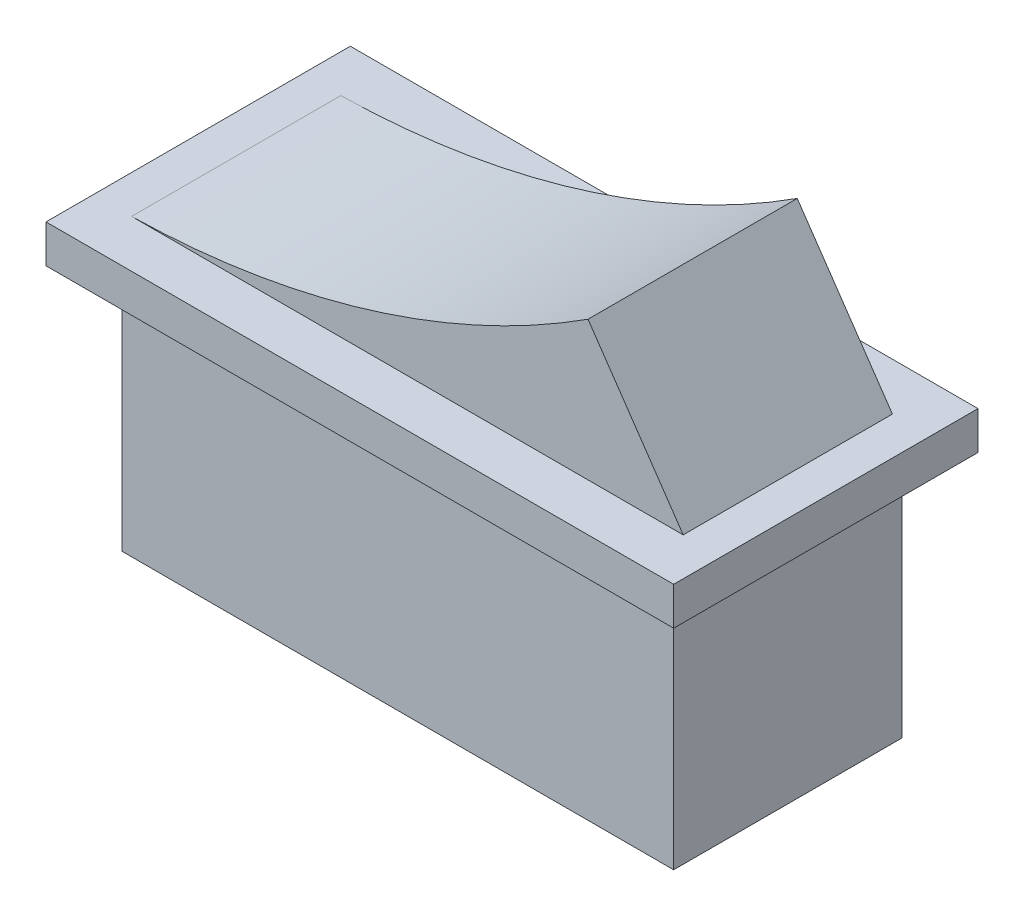
ISO-10303-21;
HEADER;
FILE_DESCRIPTION(('STEP AP214'),'2;1');
FILE_NAME('part.step','',(''),(''),'','','');
FILE_SCHEMA(('AUTOMOTIVE_DESIGN { 1 0 10303 214 1 1 1 1 }'));
ENDSEC;
DATA;
#1=APPLICATION_CONTEXT('core data for automotive mechanical design processes');
#2=APPLICATION_PROTOCOL_DEFINITION('international standard','automotive_design',2000,#1);
#3=PRODUCT_CONTEXT('',#1,'mechanical');
#4=PRODUCT('Part','Part','',(#3));
#5=PRODUCT_RELATED_PRODUCT_CATEGORY('part','',(#4));
#6=PRODUCT_DEFINITION_FORMATION('','',#4);
#7=PRODUCT_DEFINITION_CONTEXT('part definition',#1,'design');
#8=PRODUCT_DEFINITION('design','',#6,#7);
#9=PRODUCT_DEFINITION_SHAPE('','',#8);
#10=(LENGTH_UNIT() NAMED_UNIT(*) SI_UNIT(.MILLI.,.METRE.));
#11=(NAMED_UNIT(*) PLANE_ANGLE_UNIT() SI_UNIT($,.RADIAN.));
#12=(NAMED_UNIT(*) SI_UNIT($,.STERADIAN.) SOLID_ANGLE_UNIT());
#13=UNCERTAINTY_MEASURE_WITH_UNIT(LENGTH_MEASURE(1.E-05),#10,'distance_accuracy_value','');
#14=(GEOMETRIC_REPRESENTATION_CONTEXT(3) GLOBAL_UNCERTAINTY_ASSIGNED_CONTEXT((#13)) GLOBAL_UNIT_ASSIGNED_CONTEXT((#10,
#11,#12)) REPRESENTATION_CONTEXT('',''));
#15=CARTESIAN_POINT('',(0.,0.,0.));
#16=DIRECTION('',(0.,0.,1.));
#17=DIRECTION('',(1.,0.,0.));
#18=AXIS2_PLACEMENT_3D('',#15,#16,#17);
#19=CARTESIAN_POINT('',(0.,2.,0.));
#20=DIRECTION('',(0.,1.,0.));
#21=DIRECTION('',(0.,0.,1.));
#22=AXIS2_PLACEMENT_3D('',#19,#20,#21);
#23=PLANE('',#22);
#24=DIRECTION('',(0.,0.,1.));
#25=VECTOR('',#24,1.);
#26=CARTESIAN_POINT('',(-16.5,2.,-8.));
#27=LINE('',#26,#25);
#28=CARTESIAN_POINT('',(-16.5,2.,-8.));
#29=VERTEX_POINT('',#28);
#30=CARTESIAN_POINT('',(-16.5,2.,8.));
#31=VERTEX_POINT('',#30);
#32=EDGE_CURVE('E182',#29,#31,#27,.T.);
#33=ORIENTED_EDGE('',*,*,#32,.T.);
#34=DIRECTION('',(1.,0.,0.));
#35=VECTOR('',#34,1.);
#36=CARTESIAN_POINT('',(-16.5,2.,8.));
#37=LINE('',#36,#35);
#38=CARTESIAN_POINT('',(16.5,2.,8.));
#39=VERTEX_POINT('',#38);
#40=EDGE_CURVE('E185',#31,#39,#37,.T.);
#41=ORIENTED_EDGE('',*,*,#40,.T.);
#42=DIRECTION('',(0.,0.,-1.));
#43=VECTOR('',#42,1.);
#44=CARTESIAN_POINT('',(16.5,2.,-8.));
#45=LINE('',#44,#43);
#46=CARTESIAN_POINT('',(16.5,2.,-8.));
#47=VERTEX_POINT('',#46);
#48=EDGE_CURVE('E188',#39,#47,#45,.T.);
#49=ORIENTED_EDGE('',*,*,#48,.T.);
#50=DIRECTION('',(-1.,0.,0.));
#51=VECTOR('',#50,1.);
#52=CARTESIAN_POINT('',(-16.5,2.,-8.));
#53=LINE('',#52,#51);
#54=EDGE_CURVE('E190',#47,#29,#53,.T.);
#55=ORIENTED_EDGE('',*,*,#54,.T.);
#56=EDGE_LOOP('',(#33,#41,#49,#55));
#57=FACE_BOUND('',#56,.T.);
#58=DIRECTION('',(0.,0.,-1.));
#59=VECTOR('',#58,1.);
#60=CARTESIAN_POINT('',(-14.5,2.,5.5));
#61=LINE('',#60,#59);
#62=CARTESIAN_POINT('',(-14.5,2.,5.5));
#63=VERTEX_POINT('',#62);
#64=CARTESIAN_POINT('',(-14.5,2.,-5.5));
#65=VERTEX_POINT('',#64);
#66=EDGE_CURVE('E178',#63,#65,#61,.T.);
#67=ORIENTED_EDGE('',*,*,#66,.T.);
#68=DIRECTION('',(1.,0.,0.));
#69=VECTOR('',#68,1.);
#70=CARTESIAN_POINT('',(0.,2.,-5.5));
#71=LINE('',#70,#69);
#72=CARTESIAN_POINT('',(14.5,2.,-5.5));
#73=VERTEX_POINT('',#72);
#74=EDGE_CURVE('E170',#65,#73,#71,.T.);
#75=ORIENTED_EDGE('',*,*,#74,.T.);
#76=DIRECTION('',(0.,0.,-1.));
#77=VECTOR('',#76,1.);
#78=CARTESIAN_POINT('',(14.5,2.,5.5));
#79=LINE('',#78,#77);
#80=CARTESIAN_POINT('',(14.5,2.,5.5));
#81=VERTEX_POINT('',#80);
#82=EDGE_CURVE('E176',#81,#73,#79,.T.);
#83=ORIENTED_EDGE('',*,*,#82,.F.);
#84=DIRECTION('',(1.,0.,0.));
#85=VECTOR('',#84,1.);
#86=CARTESIAN_POINT('',(0.,2.,5.5));
#87=LINE('',#86,#85);
#88=EDGE_CURVE('E163',#63,#81,#87,.T.);
#89=ORIENTED_EDGE('',*,*,#88,.F.);
#90=EDGE_LOOP('',(#67,#75,#83,#89));
#91=FACE_BOUND('',#90,.T.);
#92=ADVANCED_FACE('F39',(#57,#91),#23,.T.);
#93=CARTESIAN_POINT('',(-16.5,2.,-8.));
#94=DIRECTION('',(1.,0.,0.));
#95=DIRECTION('',(0.,0.,-1.));
#96=AXIS2_PLACEMENT_3D('',#93,#94,#95);
#97=PLANE('',#96);
#98=DIRECTION('',(0.,0.,1.));
#99=VECTOR('',#98,1.);
#100=CARTESIAN_POINT('',(-16.5,0.,-8.));
#101=LINE('',#100,#99);
#102=CARTESIAN_POINT('',(-16.5,0.,-8.));
#103=VERTEX_POINT('',#102);
#104=CARTESIAN_POINT('',(-16.5,0.,8.));
#105=VERTEX_POINT('',#104);
#106=EDGE_CURVE('E181',#103,#105,#101,.T.);
#107=ORIENTED_EDGE('',*,*,#106,.T.);
#108=DIRECTION('',(0.,-1.,0.));
#109=VECTOR('',#108,1.);
#110=CARTESIAN_POINT('',(-16.5,2.,8.));
#111=LINE('',#110,#109);
#112=EDGE_CURVE('E11',#31,#105,#111,.T.);
#113=ORIENTED_EDGE('',*,*,#112,.F.);
#114=ORIENTED_EDGE('',*,*,#32,.F.);
#115=DIRECTION('',(0.,-1.,0.));
#116=VECTOR('',#115,1.);
#117=CARTESIAN_POINT('',(-16.5,2.,-8.));
#118=LINE('',#117,#116);
#119=EDGE_CURVE('E192',#29,#103,#118,.T.);
#120=ORIENTED_EDGE('',*,*,#119,.T.);
#121=EDGE_LOOP('',(#107,#113,#114,#120));
#122=FACE_BOUND('',#121,.T.);
#123=ADVANCED_FACE('F41',(#122),#97,.F.);
#124=CARTESIAN_POINT('',(-16.5,2.,8.));
#125=DIRECTION('',(0.,0.,-1.));
#126=DIRECTION('',(-1.,0.,0.));
#127=AXIS2_PLACEMENT_3D('',#124,#125,#126);
#128=PLANE('',#127);
#129=DIRECTION('',(1.,0.,0.));
#130=VECTOR('',#129,1.);
#131=CARTESIAN_POINT('',(-16.5,0.,8.));
#132=LINE('',#131,#130);
#133=CARTESIAN_POINT('',(16.5,0.,8.));
#134=VERTEX_POINT('',#133);
#135=EDGE_CURVE('E195',#105,#134,#132,.T.);
#136=ORIENTED_EDGE('',*,*,#135,.T.);
#137=DIRECTION('',(0.,-1.,0.));
#138=VECTOR('',#137,1.);
#139=CARTESIAN_POINT('',(16.5,2.,8.));
#140=LINE('',#139,#138);
#141=EDGE_CURVE('E47',#39,#134,#140,.T.);
#142=ORIENTED_EDGE('',*,*,#141,.F.);
#143=ORIENTED_EDGE('',*,*,#40,.F.);
#144=ORIENTED_EDGE('',*,*,#112,.T.);
#145=EDGE_LOOP('',(#136,#142,#143,#144));
#146=FACE_BOUND('',#145,.T.);
#147=ADVANCED_FACE('F225',(#146),#128,.F.);
#148=CARTESIAN_POINT('',(16.5,2.,-8.));
#149=DIRECTION('',(-1.,0.,0.));
#150=DIRECTION('',(0.,0.,1.));
#151=AXIS2_PLACEMENT_3D('',#148,#149,#150);
#152=PLANE('',#151);
#153=DIRECTION('',(0.,0.,-1.));
#154=VECTOR('',#153,1.);
#155=CARTESIAN_POINT('',(16.5,0.,-8.));
#156=LINE('',#155,#154);
#157=CARTESIAN_POINT('',(16.5,0.,-8.));
#158=VERTEX_POINT('',#157);
#159=EDGE_CURVE('E197',#134,#158,#156,.T.);
#160=ORIENTED_EDGE('',*,*,#159,.T.);
#161=DIRECTION('',(0.,-1.,0.));
#162=VECTOR('',#161,1.);
#163=CARTESIAN_POINT('',(16.5,2.,-8.));
#164=LINE('',#163,#162);
#165=EDGE_CURVE('E202',#47,#158,#164,.T.);
#166=ORIENTED_EDGE('',*,*,#165,.F.);
#167=ORIENTED_EDGE('',*,*,#48,.F.);
#168=ORIENTED_EDGE('',*,*,#141,.T.);
#169=EDGE_LOOP('',(#160,#166,#167,#168));
#170=FACE_BOUND('',#169,.T.);
#171=ADVANCED_FACE('F209',(#170),#152,.F.);
#172=CARTESIAN_POINT('',(-16.5,2.,-8.));
#173=DIRECTION('',(0.,0.,1.));
#174=DIRECTION('',(1.,0.,0.));
#175=AXIS2_PLACEMENT_3D('',#172,#173,#174);
#176=PLANE('',#175);
#177=DIRECTION('',(-1.,0.,0.));
#178=VECTOR('',#177,1.);
#179=CARTESIAN_POINT('',(-16.5,0.,-8.));
#180=LINE('',#179,#178);
#181=EDGE_CURVE('E186',#158,#103,#180,.T.);
#182=ORIENTED_EDGE('',*,*,#181,.T.);
#183=ORIENTED_EDGE('',*,*,#119,.F.);
#184=ORIENTED_EDGE('',*,*,#54,.F.);
#185=ORIENTED_EDGE('',*,*,#165,.T.);
#186=EDGE_LOOP('',(#182,#183,#184,#185));
#187=FACE_BOUND('',#186,.T.);
#188=ADVANCED_FACE('F218',(#187),#176,.F.);
#189=CARTESIAN_POINT('',(0.,0.,0.));
#190=DIRECTION('',(0.,1.,0.));
#191=DIRECTION('',(0.,0.,1.));
#192=AXIS2_PLACEMENT_3D('',#189,#190,#191);
#193=PLANE('',#192);
#194=DIRECTION('',(-1.,0.,0.));
#195=VECTOR('',#194,1.);
#196=CARTESIAN_POINT('',(-14.5,0.,-6.));
#197=LINE('',#196,#195);
#198=CARTESIAN_POINT('',(14.5,0.,-6.));
#199=VERTEX_POINT('',#198);
#200=CARTESIAN_POINT('',(-14.5,0.,-6.));
#201=VERTEX_POINT('',#200);
#202=EDGE_CURVE('E144',#199,#201,#197,.T.);
#203=ORIENTED_EDGE('',*,*,#202,.T.);
#204=DIRECTION('',(0.,0.,1.));
#205=VECTOR('',#204,1.);
#206=CARTESIAN_POINT('',(-14.5,0.,6.));
#207=LINE('',#206,#205);
#208=CARTESIAN_POINT('',(-14.5,0.,6.));
#209=VERTEX_POINT('',#208);
#210=EDGE_CURVE('E54',#201,#209,#207,.T.);
#211=ORIENTED_EDGE('',*,*,#210,.T.);
#212=DIRECTION('',(1.,0.,0.));
#213=VECTOR('',#212,1.);
#214=CARTESIAN_POINT('',(-14.5,0.,6.));
#215=LINE('',#214,#213);
#216=CARTESIAN_POINT('',(14.5,0.,6.));
#217=VERTEX_POINT('',#216);
#218=EDGE_CURVE('E127',#209,#217,#215,.T.);
#219=ORIENTED_EDGE('',*,*,#218,.T.);
#220=DIRECTION('',(0.,0.,-1.));
#221=VECTOR('',#220,1.);
#222=CARTESIAN_POINT('',(14.5,0.,6.));
#223=LINE('',#222,#221);
#224=EDGE_CURVE('E147',#217,#199,#223,.T.);
#225=ORIENTED_EDGE('',*,*,#224,.T.);
#226=EDGE_LOOP('',(#203,#211,#219,#225));
#227=FACE_BOUND('',#226,.T.);
#228=ORIENTED_EDGE('',*,*,#106,.F.);
#229=ORIENTED_EDGE('',*,*,#181,.F.);
#230=ORIENTED_EDGE('',*,*,#159,.F.);
#231=ORIENTED_EDGE('',*,*,#135,.F.);
#232=EDGE_LOOP('',(#228,#229,#230,#231));
#233=FACE_BOUND('',#232,.T.);
#234=ADVANCED_FACE('F215',(#227,#233),#193,.F.);
#235=CARTESIAN_POINT('',(-15.4049338038436,47.9738957463678,5.5));
#236=DIRECTION('',(0.,0.,-1.));
#237=DIRECTION('',(-1.,0.,0.));
#238=AXIS2_PLACEMENT_3D('',#235,#236,#237);
#239=CYLINDRICAL_SURFACE('',#238,45.9828010813526);
#240=CARTESIAN_POINT('',(-15.4049338038436,47.9738957463678,-5.5));
#241=DIRECTION('',(0.,0.,1.));
#242=DIRECTION('',(1.,0.,0.));
#243=AXIS2_PLACEMENT_3D('',#240,#241,#242);
#244=CIRCLE('',#243,45.9828010813526);
#245=CARTESIAN_POINT('',(9.49688762634903,9.31749543870808,-5.5));
#246=VERTEX_POINT('',#245);
#247=EDGE_CURVE('E62',#65,#246,#244,.T.);
#248=ORIENTED_EDGE('',*,*,#247,.F.);
#249=ORIENTED_EDGE('',*,*,#66,.F.);
#250=CARTESIAN_POINT('',(-15.4049338038436,47.9738957463678,5.5));
#251=DIRECTION('',(0.,0.,1.));
#252=DIRECTION('',(1.,0.,0.));
#253=AXIS2_PLACEMENT_3D('',#250,#251,#252);
#254=CIRCLE('',#253,45.9828010813526);
#255=CARTESIAN_POINT('',(9.49688762634903,9.31749543870808,5.5));
#256=VERTEX_POINT('',#255);
#257=EDGE_CURVE('E160',#63,#256,#254,.T.);
#258=ORIENTED_EDGE('',*,*,#257,.T.);
#259=DIRECTION('',(0.,0.,-1.));
#260=VECTOR('',#259,1.);
#261=CARTESIAN_POINT('',(9.49688762634903,9.31749543870808,5.5));
#262=LINE('',#261,#260);
#263=EDGE_CURVE('E168',#256,#246,#262,.T.);
#264=ORIENTED_EDGE('',*,*,#263,.T.);
#265=EDGE_LOOP('',(#248,#249,#258,#264));
#266=FACE_BOUND('',#265,.T.);
#267=ADVANCED_FACE('F238',(#266),#239,.F.);
#268=CARTESIAN_POINT('',(10.8127709219099,7.39289944845007,5.5));
#269=DIRECTION('',(-0.825496221391892,-0.564407643877816,0.));
#270=DIRECTION('',(0.564407643877816,-0.825496221391892,0.));
#271=AXIS2_PLACEMENT_3D('',#268,#269,#270);
#272=PLANE('',#271);
#273=DIRECTION('',(-0.564407643877816,0.825496221391892,0.));
#274=VECTOR('',#273,1.);
#275=CARTESIAN_POINT('',(10.8127709219099,7.39289944845007,-5.5));
#276=LINE('',#275,#274);
#277=EDGE_CURVE('E164',#73,#246,#276,.T.);
#278=ORIENTED_EDGE('',*,*,#277,.T.);
#279=ORIENTED_EDGE('',*,*,#263,.F.);
#280=DIRECTION('',(-0.564407643877816,0.825496221391892,0.));
#281=VECTOR('',#280,1.);
#282=CARTESIAN_POINT('',(10.8127709219099,7.39289944845007,5.5));
#283=LINE('',#282,#281);
#284=EDGE_CURVE('E166',#81,#256,#283,.T.);
#285=ORIENTED_EDGE('',*,*,#284,.F.);
#286=ORIENTED_EDGE('',*,*,#82,.T.);
#287=EDGE_LOOP('',(#278,#279,#285,#286));
#288=FACE_BOUND('',#287,.T.);
#289=ADVANCED_FACE('F260',(#288),#272,.F.);
#290=CARTESIAN_POINT('',(0.,0.,5.5));
#291=DIRECTION('',(0.,0.,1.));
#292=DIRECTION('',(1.,0.,0.));
#293=AXIS2_PLACEMENT_3D('',#290,#291,#292);
#294=PLANE('',#293);
#295=ORIENTED_EDGE('',*,*,#257,.F.);
#296=ORIENTED_EDGE('',*,*,#88,.T.);
#297=ORIENTED_EDGE('',*,*,#284,.T.);
#298=EDGE_LOOP('',(#295,#296,#297));
#299=FACE_BOUND('',#298,.T.);
#300=ADVANCED_FACE('F266',(#299),#294,.T.);
#301=CARTESIAN_POINT('',(0.,0.,-5.5));
#302=DIRECTION('',(0.,0.,1.));
#303=DIRECTION('',(1.,0.,0.));
#304=AXIS2_PLACEMENT_3D('',#301,#302,#303);
#305=PLANE('',#304);
#306=ORIENTED_EDGE('',*,*,#247,.T.);
#307=ORIENTED_EDGE('',*,*,#277,.F.);
#308=ORIENTED_EDGE('',*,*,#74,.F.);
#309=EDGE_LOOP('',(#306,#307,#308));
#310=FACE_BOUND('',#309,.T.);
#311=ADVANCED_FACE('F273',(#310),#305,.F.);
#312=CARTESIAN_POINT('',(-14.5,-13.,6.));
#313=DIRECTION('',(-1.,0.,0.));
#314=DIRECTION('',(0.,0.,1.));
#315=AXIS2_PLACEMENT_3D('',#312,#313,#314);
#316=PLANE('',#315);
#317=ORIENTED_EDGE('',*,*,#210,.F.);
#318=DIRECTION('',(0.,1.,0.));
#319=VECTOR('',#318,1.);
#320=CARTESIAN_POINT('',(-14.5,-13.,-6.));
#321=LINE('',#320,#319);
#322=CARTESIAN_POINT('',(-14.5,-13.,-6.));
#323=VERTEX_POINT('',#322);
#324=EDGE_CURVE('E143',#323,#201,#321,.T.);
#325=ORIENTED_EDGE('',*,*,#324,.F.);
#326=DIRECTION('',(0.,0.,1.));
#327=VECTOR('',#326,1.);
#328=CARTESIAN_POINT('',(-14.5,-13.,6.));
#329=LINE('',#328,#327);
#330=CARTESIAN_POINT('',(-14.5,-13.,6.));
#331=VERTEX_POINT('',#330);
#332=EDGE_CURVE('E137',#323,#331,#329,.T.);
#333=ORIENTED_EDGE('',*,*,#332,.T.);
#334=DIRECTION('',(0.,1.,0.));
#335=VECTOR('',#334,1.);
#336=CARTESIAN_POINT('',(-14.5,-13.,6.));
#337=LINE('',#336,#335);
#338=EDGE_CURVE('E122',#331,#209,#337,.T.);
#339=ORIENTED_EDGE('',*,*,#338,.T.);
#340=EDGE_LOOP('',(#317,#325,#333,#339));
#341=FACE_BOUND('',#340,.T.);
#342=ADVANCED_FACE('F142',(#341),#316,.T.);
#343=CARTESIAN_POINT('',(-14.5,-13.,-6.));
#344=DIRECTION('',(0.,0.,-1.));
#345=DIRECTION('',(-1.,0.,0.));
#346=AXIS2_PLACEMENT_3D('',#343,#344,#345);
#347=PLANE('',#346);
#348=ORIENTED_EDGE('',*,*,#202,.F.);
#349=DIRECTION('',(0.,1.,0.));
#350=VECTOR('',#349,1.);
#351=CARTESIAN_POINT('',(14.5,-13.,-6.));
#352=LINE('',#351,#350);
#353=CARTESIAN_POINT('',(14.5,-13.,-6.));
#354=VERTEX_POINT('',#353);
#355=EDGE_CURVE('E157',#354,#199,#352,.T.);
#356=ORIENTED_EDGE('',*,*,#355,.F.);
#357=DIRECTION('',(-1.,0.,0.));
#358=VECTOR('',#357,1.);
#359=CARTESIAN_POINT('',(-14.5,-13.,-6.));
#360=LINE('',#359,#358);
#361=EDGE_CURVE('E130',#354,#323,#360,.T.);
#362=ORIENTED_EDGE('',*,*,#361,.T.);
#363=ORIENTED_EDGE('',*,*,#324,.T.);
#364=EDGE_LOOP('',(#348,#356,#362,#363));
#365=FACE_BOUND('',#364,.T.);
#366=ADVANCED_FACE('F286',(#365),#347,.T.);
#367=CARTESIAN_POINT('',(14.5,-13.,6.));
#368=DIRECTION('',(1.,0.,0.));
#369=DIRECTION('',(0.,0.,-1.));
#370=AXIS2_PLACEMENT_3D('',#367,#368,#369);
#371=PLANE('',#370);
#372=ORIENTED_EDGE('',*,*,#224,.F.);
#373=DIRECTION('',(0.,1.,0.));
#374=VECTOR('',#373,1.);
#375=CARTESIAN_POINT('',(14.5,-13.,6.));
#376=LINE('',#375,#374);
#377=CARTESIAN_POINT('',(14.5,-13.,6.));
#378=VERTEX_POINT('',#377);
#379=EDGE_CURVE('E129',#378,#217,#376,.T.);
#380=ORIENTED_EDGE('',*,*,#379,.F.);
#381=DIRECTION('',(0.,0.,-1.));
#382=VECTOR('',#381,1.);
#383=CARTESIAN_POINT('',(14.5,-13.,6.));
#384=LINE('',#383,#382);
#385=EDGE_CURVE('E140',#378,#354,#384,.T.);
#386=ORIENTED_EDGE('',*,*,#385,.T.);
#387=ORIENTED_EDGE('',*,*,#355,.T.);
#388=EDGE_LOOP('',(#372,#380,#386,#387));
#389=FACE_BOUND('',#388,.T.);
#390=ADVANCED_FACE('F293',(#389),#371,.T.);
#391=CARTESIAN_POINT('',(-14.5,-13.,6.));
#392=DIRECTION('',(0.,0.,1.));
#393=DIRECTION('',(1.,0.,0.));
#394=AXIS2_PLACEMENT_3D('',#391,#392,#393);
#395=PLANE('',#394);
#396=ORIENTED_EDGE('',*,*,#218,.F.);
#397=ORIENTED_EDGE('',*,*,#338,.F.);
#398=DIRECTION('',(1.,0.,0.));
#399=VECTOR('',#398,1.);
#400=CARTESIAN_POINT('',(-14.5,-13.,6.));
#401=LINE('',#400,#399);
#402=EDGE_CURVE('E125',#331,#378,#401,.T.);
#403=ORIENTED_EDGE('',*,*,#402,.T.);
#404=ORIENTED_EDGE('',*,*,#379,.T.);
#405=EDGE_LOOP('',(#396,#397,#403,#404));
#406=FACE_BOUND('',#405,.T.);
#407=ADVANCED_FACE('F124',(#406),#395,.T.);
#408=CARTESIAN_POINT('',(0.,-13.,0.));
#409=DIRECTION('',(0.,-1.,0.));
#410=DIRECTION('',(0.,0.,-1.));
#411=AXIS2_PLACEMENT_3D('',#408,#409,#410);
#412=PLANE('',#411);
#413=ORIENTED_EDGE('',*,*,#332,.F.);
#414=ORIENTED_EDGE('',*,*,#361,.F.);
#415=ORIENTED_EDGE('',*,*,#385,.F.);
#416=ORIENTED_EDGE('',*,*,#402,.F.);
#417=EDGE_LOOP('',(#413,#414,#415,#416));
#418=FACE_BOUND('',#417,.T.);
#419=ADVANCED_FACE('F135',(#418),#412,.T.);
#420=CLOSED_SHELL('',(#92,#123,#147,#171,#188,#234,#267,#289,#300,#311,#342,#366,#390,#407,#419));
#421=MANIFOLD_SOLID_BREP('B2',#420);
#422=ADVANCED_BREP_SHAPE_REPRESENTATION('',(#18,#421),#14);
#423=SHAPE_DEFINITION_REPRESENTATION(#9,#422);
ENDSEC;
END-ISO-10303-21;
